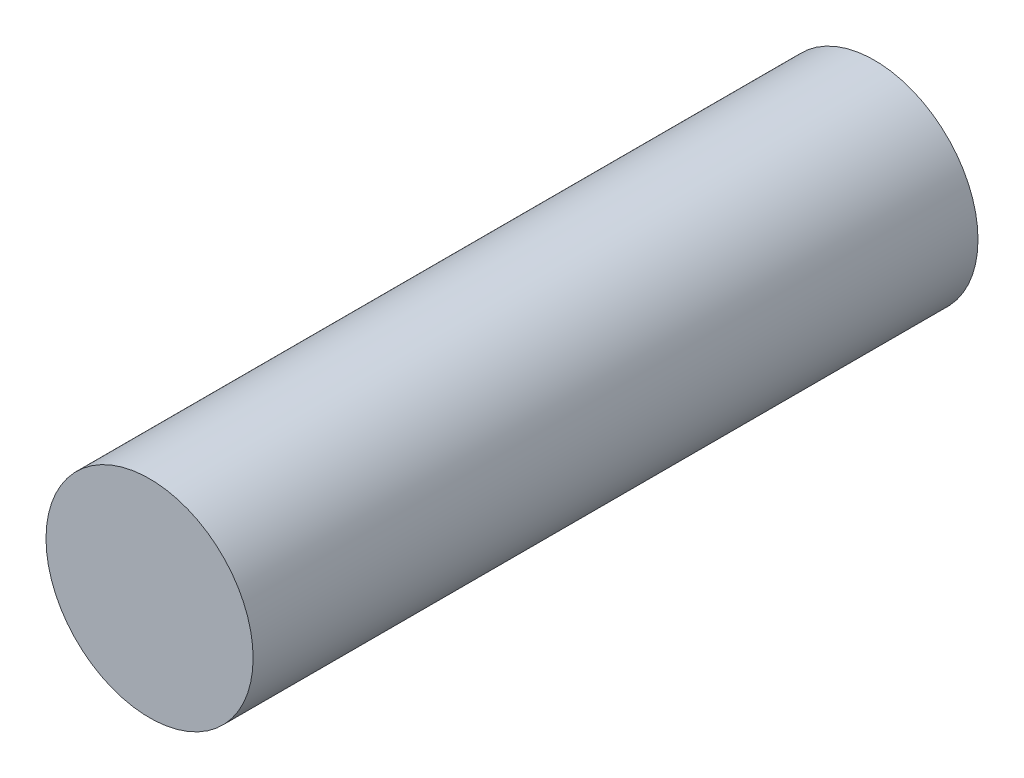
ISO-10303-21;
HEADER;
FILE_DESCRIPTION(('STEP AP214'),'2;1');
FILE_NAME('part.step','',(''),(''),'','','');
FILE_SCHEMA(('AUTOMOTIVE_DESIGN { 1 0 10303 214 1 1 1 1 }'));
ENDSEC;
DATA;
#1=APPLICATION_CONTEXT('core data for automotive mechanical design processes');
#2=APPLICATION_PROTOCOL_DEFINITION('international standard','automotive_design',2000,#1);
#3=PRODUCT_CONTEXT('',#1,'mechanical');
#4=PRODUCT('Part','Part','',(#3));
#5=PRODUCT_RELATED_PRODUCT_CATEGORY('part','',(#4));
#6=PRODUCT_DEFINITION_FORMATION('','',#4);
#7=PRODUCT_DEFINITION_CONTEXT('part definition',#1,'design');
#8=PRODUCT_DEFINITION('design','',#6,#7);
#9=PRODUCT_DEFINITION_SHAPE('','',#8);
#10=(LENGTH_UNIT() NAMED_UNIT(*) SI_UNIT(.MILLI.,.METRE.));
#11=(NAMED_UNIT(*) PLANE_ANGLE_UNIT() SI_UNIT($,.RADIAN.));
#12=(NAMED_UNIT(*) SI_UNIT($,.STERADIAN.) SOLID_ANGLE_UNIT());
#13=UNCERTAINTY_MEASURE_WITH_UNIT(LENGTH_MEASURE(1.E-05),#10,'distance_accuracy_value','');
#14=(GEOMETRIC_REPRESENTATION_CONTEXT(3) GLOBAL_UNCERTAINTY_ASSIGNED_CONTEXT((#13)) GLOBAL_UNIT_ASSIGNED_CONTEXT((#10,
#11,#12)) REPRESENTATION_CONTEXT('',''));
#15=CARTESIAN_POINT('',(0.,0.,0.));
#16=DIRECTION('',(0.,0.,1.));
#17=DIRECTION('',(1.,0.,0.));
#18=AXIS2_PLACEMENT_3D('',#15,#16,#17);
#19=CARTESIAN_POINT('',(0.,0.,7.));
#20=DIRECTION('',(0.,0.,1.));
#21=DIRECTION('',(1.,0.,0.));
#22=AXIS2_PLACEMENT_3D('',#19,#20,#21);
#23=PLANE('',#22);
#24=CARTESIAN_POINT('',(0.,0.,7.));
#25=DIRECTION('',(0.,0.,-1.));
#26=DIRECTION('',(-1.,0.,0.));
#27=AXIS2_PLACEMENT_3D('',#24,#25,#26);
#28=CIRCLE('',#27,1.);
#29=CARTESIAN_POINT('',(-1.,0.,7.));
#30=VERTEX_POINT('',#29);
#31=EDGE_CURVE('E18',#30,#30,#28,.T.);
#32=ORIENTED_EDGE('',*,*,#31,.F.);
#33=EDGE_LOOP('',(#32));
#34=FACE_BOUND('',#33,.T.);
#35=ADVANCED_FACE('F15',(#34),#23,.T.);
#36=CARTESIAN_POINT('',(0.,0.,0.));
#37=DIRECTION('',(0.,0.,1.));
#38=DIRECTION('',(1.,0.,0.));
#39=AXIS2_PLACEMENT_3D('',#36,#37,#38);
#40=PLANE('',#39);
#41=CARTESIAN_POINT('',(0.,0.,0.));
#42=DIRECTION('',(0.,0.,-1.));
#43=DIRECTION('',(-1.,0.,0.));
#44=AXIS2_PLACEMENT_3D('',#41,#42,#43);
#45=CIRCLE('',#44,1.);
#46=CARTESIAN_POINT('',(-1.,0.,0.));
#47=VERTEX_POINT('',#46);
#48=EDGE_CURVE('E10',#47,#47,#45,.F.);
#49=ORIENTED_EDGE('',*,*,#48,.F.);
#50=EDGE_LOOP('',(#49));
#51=FACE_BOUND('',#50,.T.);
#52=ADVANCED_FACE('F30',(#51),#40,.F.);
#53=CARTESIAN_POINT('',(0.,0.,7.));
#54=DIRECTION('',(0.,0.,-1.));
#55=DIRECTION('',(-1.,0.,0.));
#56=AXIS2_PLACEMENT_3D('',#53,#54,#55);
#57=CYLINDRICAL_SURFACE('',#56,1.);
#58=ORIENTED_EDGE('',*,*,#48,.T.);
#59=EDGE_LOOP('',(#58));
#60=FACE_BOUND('',#59,.T.);
#61=ORIENTED_EDGE('',*,*,#31,.T.);
#62=EDGE_LOOP('',(#61));
#63=FACE_BOUND('',#62,.T.);
#64=ADVANCED_FACE('F27',(#60,#63),#57,.T.);
#65=CLOSED_SHELL('',(#35,#52,#64));
#66=MANIFOLD_SOLID_BREP('B1',#65);
#67=ADVANCED_BREP_SHAPE_REPRESENTATION('',(#18,#66),#14);
#68=SHAPE_DEFINITION_REPRESENTATION(#9,#67);
ENDSEC;
END-ISO-10303-21;
